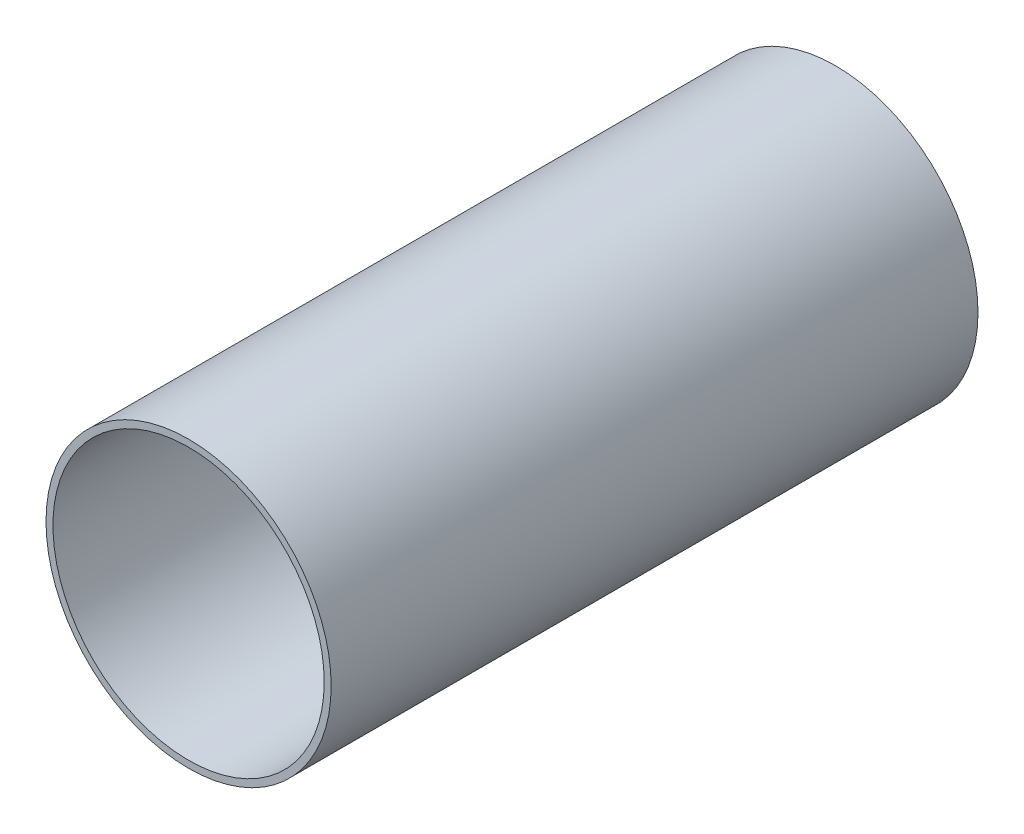
ISO-10303-21;
HEADER;
FILE_DESCRIPTION(('STEP AP214'),'2;1');
FILE_NAME('part.step','',(''),(''),'','','');
FILE_SCHEMA(('AUTOMOTIVE_DESIGN { 1 0 10303 214 1 1 1 1 }'));
ENDSEC;
DATA;
#1=APPLICATION_CONTEXT('core data for automotive mechanical design processes');
#2=APPLICATION_PROTOCOL_DEFINITION('international standard','automotive_design',2000,#1);
#3=PRODUCT_CONTEXT('',#1,'mechanical');
#4=PRODUCT('Part','Part','',(#3));
#5=PRODUCT_RELATED_PRODUCT_CATEGORY('part','',(#4));
#6=PRODUCT_DEFINITION_FORMATION('','',#4);
#7=PRODUCT_DEFINITION_CONTEXT('part definition',#1,'design');
#8=PRODUCT_DEFINITION('design','',#6,#7);
#9=PRODUCT_DEFINITION_SHAPE('','',#8);
#10=(LENGTH_UNIT() NAMED_UNIT(*) SI_UNIT(.MILLI.,.METRE.));
#11=(NAMED_UNIT(*) PLANE_ANGLE_UNIT() SI_UNIT($,.RADIAN.));
#12=(NAMED_UNIT(*) SI_UNIT($,.STERADIAN.) SOLID_ANGLE_UNIT());
#13=UNCERTAINTY_MEASURE_WITH_UNIT(LENGTH_MEASURE(1.E-05),#10,'distance_accuracy_value','');
#14=(GEOMETRIC_REPRESENTATION_CONTEXT(3) GLOBAL_UNCERTAINTY_ASSIGNED_CONTEXT((#13)) GLOBAL_UNIT_ASSIGNED_CONTEXT((#10,
#11,#12)) REPRESENTATION_CONTEXT('',''));
#15=CARTESIAN_POINT('',(0.,0.,0.));
#16=DIRECTION('',(0.,0.,1.));
#17=DIRECTION('',(1.,0.,0.));
#18=AXIS2_PLACEMENT_3D('',#15,#16,#17);
#19=CARTESIAN_POINT('',(0.,0.,93.));
#20=DIRECTION('',(0.,0.,-1.));
#21=DIRECTION('',(-1.,0.,0.));
#22=AXIS2_PLACEMENT_3D('',#19,#20,#21);
#23=CYLINDRICAL_SURFACE('',#22,20.5);
#24=CARTESIAN_POINT('',(0.,0.,93.));
#25=DIRECTION('',(0.,0.,1.));
#26=DIRECTION('',(1.,0.,0.));
#27=AXIS2_PLACEMENT_3D('',#24,#25,#26);
#28=CIRCLE('',#27,20.5);
#29=CARTESIAN_POINT('',(20.5,0.,93.));
#30=VERTEX_POINT('',#29);
#31=EDGE_CURVE('E10',#30,#30,#28,.T.);
#32=ORIENTED_EDGE('',*,*,#31,.F.);
#33=EDGE_LOOP('',(#32));
#34=FACE_BOUND('',#33,.T.);
#35=CARTESIAN_POINT('',(0.,0.,0.));
#36=DIRECTION('',(0.,0.,1.));
#37=DIRECTION('',(1.,0.,0.));
#38=AXIS2_PLACEMENT_3D('',#35,#36,#37);
#39=CIRCLE('',#38,20.5);
#40=CARTESIAN_POINT('',(20.5,0.,0.));
#41=VERTEX_POINT('',#40);
#42=EDGE_CURVE('E36',#41,#41,#39,.T.);
#43=ORIENTED_EDGE('',*,*,#42,.T.);
#44=EDGE_LOOP('',(#43));
#45=FACE_BOUND('',#44,.T.);
#46=ADVANCED_FACE('F33',(#34,#45),#23,.T.);
#47=CARTESIAN_POINT('',(0.,0.,93.));
#48=DIRECTION('',(0.,0.,1.));
#49=DIRECTION('',(1.,0.,0.));
#50=AXIS2_PLACEMENT_3D('',#47,#48,#49);
#51=PLANE('',#50);
#52=CARTESIAN_POINT('',(0.,0.,93.));
#53=DIRECTION('',(0.,0.,1.));
#54=DIRECTION('',(1.,0.,0.));
#55=AXIS2_PLACEMENT_3D('',#52,#53,#54);
#56=CIRCLE('',#55,19.5);
#57=CARTESIAN_POINT('',(19.5,0.,93.));
#58=VERTEX_POINT('',#57);
#59=EDGE_CURVE('E45',#58,#58,#56,.T.);
#60=ORIENTED_EDGE('',*,*,#59,.F.);
#61=EDGE_LOOP('',(#60));
#62=FACE_BOUND('',#61,.T.);
#63=ORIENTED_EDGE('',*,*,#31,.T.);
#64=EDGE_LOOP('',(#63));
#65=FACE_BOUND('',#64,.T.);
#66=ADVANCED_FACE('F60',(#62,#65),#51,.T.);
#67=CARTESIAN_POINT('',(0.,0.,0.));
#68=DIRECTION('',(0.,0.,1.));
#69=DIRECTION('',(1.,0.,0.));
#70=AXIS2_PLACEMENT_3D('',#67,#68,#69);
#71=PLANE('',#70);
#72=CARTESIAN_POINT('',(0.,0.,0.));
#73=DIRECTION('',(0.,0.,1.));
#74=DIRECTION('',(1.,0.,0.));
#75=AXIS2_PLACEMENT_3D('',#72,#73,#74);
#76=CIRCLE('',#75,19.5);
#77=CARTESIAN_POINT('',(19.5,0.,0.));
#78=VERTEX_POINT('',#77);
#79=EDGE_CURVE('E43',#78,#78,#76,.T.);
#80=ORIENTED_EDGE('',*,*,#79,.T.);
#81=EDGE_LOOP('',(#80));
#82=FACE_BOUND('',#81,.T.);
#83=ORIENTED_EDGE('',*,*,#42,.F.);
#84=EDGE_LOOP('',(#83));
#85=FACE_BOUND('',#84,.T.);
#86=ADVANCED_FACE('F51',(#82,#85),#71,.F.);
#87=CARTESIAN_POINT('',(0.,0.,0.));
#88=DIRECTION('',(0.,0.,1.));
#89=DIRECTION('',(1.,0.,0.));
#90=AXIS2_PLACEMENT_3D('',#87,#88,#89);
#91=CYLINDRICAL_SURFACE('',#90,19.5);
#92=ORIENTED_EDGE('',*,*,#79,.F.);
#93=EDGE_LOOP('',(#92));
#94=FACE_BOUND('',#93,.T.);
#95=ORIENTED_EDGE('',*,*,#59,.T.);
#96=EDGE_LOOP('',(#95));
#97=FACE_BOUND('',#96,.T.);
#98=ADVANCED_FACE('F54',(#94,#97),#91,.F.);
#99=CLOSED_SHELL('',(#46,#66,#86,#98));
#100=MANIFOLD_SOLID_BREP('B2',#99);
#101=ADVANCED_BREP_SHAPE_REPRESENTATION('',(#18,#100),#14);
#102=SHAPE_DEFINITION_REPRESENTATION(#9,#101);
ENDSEC;
END-ISO-10303-21;
